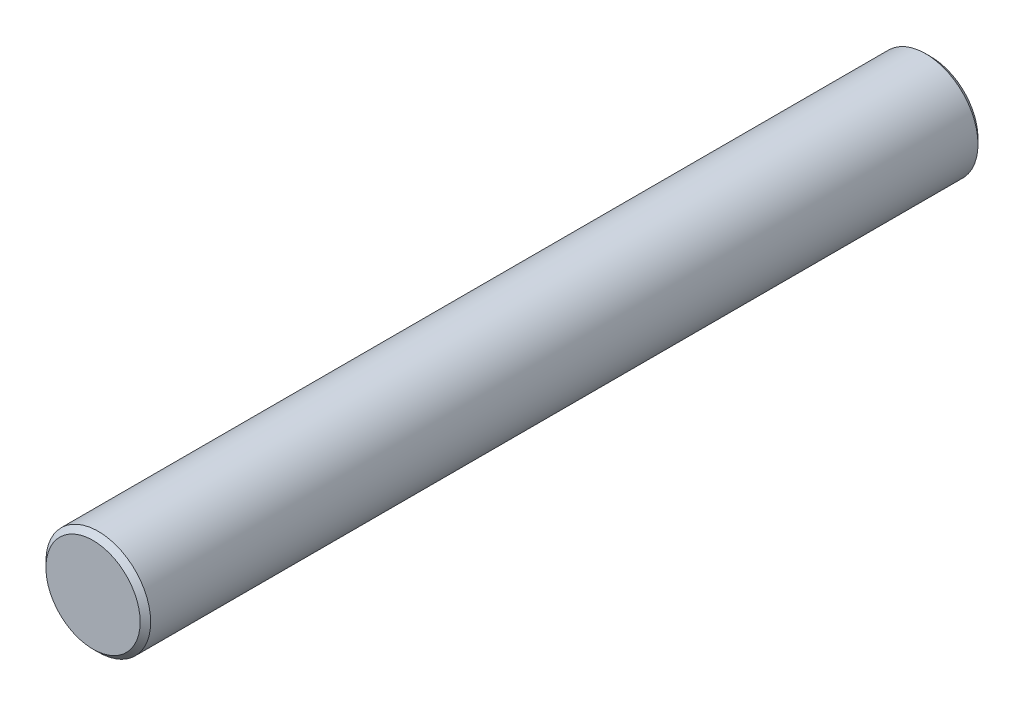
ISO-10303-21;
HEADER;
FILE_DESCRIPTION(('STEP AP214'),'2;1');
FILE_NAME('part.step','',(''),(''),'','','');
FILE_SCHEMA(('AUTOMOTIVE_DESIGN { 1 0 10303 214 1 1 1 1 }'));
ENDSEC;
DATA;
#1=APPLICATION_CONTEXT('core data for automotive mechanical design processes');
#2=APPLICATION_PROTOCOL_DEFINITION('international standard','automotive_design',2000,#1);
#3=PRODUCT_CONTEXT('',#1,'mechanical');
#4=PRODUCT('Part','Part','',(#3));
#5=PRODUCT_RELATED_PRODUCT_CATEGORY('part','',(#4));
#6=PRODUCT_DEFINITION_FORMATION('','',#4);
#7=PRODUCT_DEFINITION_CONTEXT('part definition',#1,'design');
#8=PRODUCT_DEFINITION('design','',#6,#7);
#9=PRODUCT_DEFINITION_SHAPE('','',#8);
#10=(LENGTH_UNIT() NAMED_UNIT(*) SI_UNIT(.MILLI.,.METRE.));
#11=(NAMED_UNIT(*) PLANE_ANGLE_UNIT() SI_UNIT($,.RADIAN.));
#12=(NAMED_UNIT(*) SI_UNIT($,.STERADIAN.) SOLID_ANGLE_UNIT());
#13=UNCERTAINTY_MEASURE_WITH_UNIT(LENGTH_MEASURE(1.E-05),#10,'distance_accuracy_value','');
#14=(GEOMETRIC_REPRESENTATION_CONTEXT(3) GLOBAL_UNCERTAINTY_ASSIGNED_CONTEXT((#13)) GLOBAL_UNIT_ASSIGNED_CONTEXT((#10,
#11,#12)) REPRESENTATION_CONTEXT('',''));
#15=CARTESIAN_POINT('',(0.,0.,0.));
#16=DIRECTION('',(0.,0.,1.));
#17=DIRECTION('',(1.,0.,0.));
#18=AXIS2_PLACEMENT_3D('',#15,#16,#17);
#19=CARTESIAN_POINT('',(0.,0.,24.));
#20=DIRECTION('',(0.,0.,-1.));
#21=DIRECTION('',(-1.,0.,0.));
#22=AXIS2_PLACEMENT_3D('',#19,#20,#21);
#23=CYLINDRICAL_SURFACE('',#22,1.5);
#24=CARTESIAN_POINT('',(0.,0.,23.85));
#25=DIRECTION('',(0.,0.,1.));
#26=DIRECTION('',(1.,0.,0.));
#27=AXIS2_PLACEMENT_3D('',#24,#25,#26);
#28=CIRCLE('',#27,1.5);
#29=CARTESIAN_POINT('',(1.5,0.,23.85));
#30=VERTEX_POINT('',#29);
#31=EDGE_CURVE('E45',#30,#30,#28,.F.);
#32=ORIENTED_EDGE('',*,*,#31,.T.);
#33=EDGE_LOOP('',(#32));
#34=FACE_BOUND('',#33,.T.);
#35=CARTESIAN_POINT('',(0.,0.,0.149999999999997));
#36=DIRECTION('',(0.,0.,1.));
#37=DIRECTION('',(1.,0.,0.));
#38=AXIS2_PLACEMENT_3D('',#35,#36,#37);
#39=CIRCLE('',#38,1.5);
#40=CARTESIAN_POINT('',(1.5,0.,0.149999999999997));
#41=VERTEX_POINT('',#40);
#42=EDGE_CURVE('E50',#41,#41,#39,.T.);
#43=ORIENTED_EDGE('',*,*,#42,.T.);
#44=EDGE_LOOP('',(#43));
#45=FACE_BOUND('',#44,.T.);
#46=ADVANCED_FACE('F37',(#34,#45),#23,.T.);
#47=CARTESIAN_POINT('',(0.,0.,24.));
#48=DIRECTION('',(0.,0.,1.));
#49=DIRECTION('',(1.,0.,0.));
#50=AXIS2_PLACEMENT_3D('',#47,#48,#49);
#51=PLANE('',#50);
#52=CARTESIAN_POINT('',(0.,0.,24.));
#53=DIRECTION('',(0.,0.,1.));
#54=DIRECTION('',(1.,0.,0.));
#55=AXIS2_PLACEMENT_3D('',#52,#53,#54);
#56=CIRCLE('',#55,1.35);
#57=CARTESIAN_POINT('',(1.35,0.,24.));
#58=VERTEX_POINT('',#57);
#59=EDGE_CURVE('E55',#58,#58,#56,.T.);
#60=ORIENTED_EDGE('',*,*,#59,.T.);
#61=EDGE_LOOP('',(#60));
#62=FACE_BOUND('',#61,.T.);
#63=ADVANCED_FACE('F62',(#62),#51,.T.);
#64=CARTESIAN_POINT('',(0.,0.,0.));
#65=DIRECTION('',(0.,0.,1.));
#66=DIRECTION('',(1.,0.,0.));
#67=AXIS2_PLACEMENT_3D('',#64,#65,#66);
#68=PLANE('',#67);
#69=CARTESIAN_POINT('',(0.,0.,0.));
#70=DIRECTION('',(0.,0.,1.));
#71=DIRECTION('',(1.,0.,0.));
#72=AXIS2_PLACEMENT_3D('',#69,#70,#71);
#73=CIRCLE('',#72,1.35);
#74=CARTESIAN_POINT('',(1.35,0.,0.));
#75=VERTEX_POINT('',#74);
#76=EDGE_CURVE('E10',#75,#75,#73,.F.);
#77=ORIENTED_EDGE('',*,*,#76,.T.);
#78=EDGE_LOOP('',(#77));
#79=FACE_BOUND('',#78,.T.);
#80=ADVANCED_FACE('F66',(#79),#68,.F.);
#81=CARTESIAN_POINT('',(0.,0.,24.));
#82=DIRECTION('',(0.,0.,-1.));
#83=DIRECTION('',(-1.,0.,0.));
#84=AXIS2_PLACEMENT_3D('',#81,#82,#83);
#85=CONICAL_SURFACE('',#84,1.35,0.785398163397433);
#86=ORIENTED_EDGE('',*,*,#31,.F.);
#87=EDGE_LOOP('',(#86));
#88=FACE_BOUND('',#87,.T.);
#89=ORIENTED_EDGE('',*,*,#59,.F.);
#90=EDGE_LOOP('',(#89));
#91=FACE_BOUND('',#90,.T.);
#92=ADVANCED_FACE('F64',(#88,#91),#85,.T.);
#93=CARTESIAN_POINT('',(0.,0.,0.149999999999997));
#94=DIRECTION('',(0.,0.,1.));
#95=DIRECTION('',(1.,0.,0.));
#96=AXIS2_PLACEMENT_3D('',#93,#94,#95);
#97=CONICAL_SURFACE('',#96,1.5,0.785398163397455);
#98=ORIENTED_EDGE('',*,*,#76,.F.);
#99=EDGE_LOOP('',(#98));
#100=FACE_BOUND('',#99,.T.);
#101=ORIENTED_EDGE('',*,*,#42,.F.);
#102=EDGE_LOOP('',(#101));
#103=FACE_BOUND('',#102,.T.);
#104=ADVANCED_FACE('F39',(#100,#103),#97,.T.);
#105=CLOSED_SHELL('',(#46,#63,#80,#92,#104));
#106=MANIFOLD_SOLID_BREP('B2',#105);
#107=ADVANCED_BREP_SHAPE_REPRESENTATION('',(#18,#106),#14);
#108=SHAPE_DEFINITION_REPRESENTATION(#9,#107);
ENDSEC;
END-ISO-10303-21;
